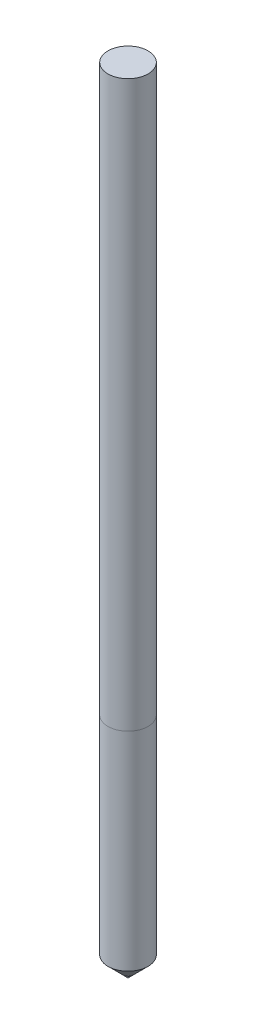
ISO-10303-21;
HEADER;
FILE_DESCRIPTION(('STEP AP214'),'2;1');
FILE_NAME('part.step','',(''),(''),'','','');
FILE_SCHEMA(('AUTOMOTIVE_DESIGN { 1 0 10303 214 1 1 1 1 }'));
ENDSEC;
DATA;
#1=APPLICATION_CONTEXT('core data for automotive mechanical design processes');
#2=APPLICATION_PROTOCOL_DEFINITION('international standard','automotive_design',2000,#1);
#3=PRODUCT_CONTEXT('',#1,'mechanical');
#4=PRODUCT('Part','Part','',(#3));
#5=PRODUCT_RELATED_PRODUCT_CATEGORY('part','',(#4));
#6=PRODUCT_DEFINITION_FORMATION('','',#4);
#7=PRODUCT_DEFINITION_CONTEXT('part definition',#1,'design');
#8=PRODUCT_DEFINITION('design','',#6,#7);
#9=PRODUCT_DEFINITION_SHAPE('','',#8);
#10=(LENGTH_UNIT() NAMED_UNIT(*) SI_UNIT(.MILLI.,.METRE.));
#11=(NAMED_UNIT(*) PLANE_ANGLE_UNIT() SI_UNIT($,.RADIAN.));
#12=(NAMED_UNIT(*) SI_UNIT($,.STERADIAN.) SOLID_ANGLE_UNIT());
#13=UNCERTAINTY_MEASURE_WITH_UNIT(LENGTH_MEASURE(1.E-05),#10,'distance_accuracy_value','');
#14=(GEOMETRIC_REPRESENTATION_CONTEXT(3) GLOBAL_UNCERTAINTY_ASSIGNED_CONTEXT((#13)) GLOBAL_UNIT_ASSIGNED_CONTEXT((#10,
#11,#12)) REPRESENTATION_CONTEXT('',''));
#15=CARTESIAN_POINT('',(0.,0.,0.));
#16=DIRECTION('',(0.,0.,1.));
#17=DIRECTION('',(1.,0.,0.));
#18=AXIS2_PLACEMENT_3D('',#15,#16,#17);
#19=CARTESIAN_POINT('',(1.41692612942607,-73.413671521868,0.));
#20=DIRECTION('',(0.,-1.,0.));
#21=DIRECTION('',(1.,0.,0.));
#22=AXIS2_PLACEMENT_3D('',#19,#20,#21);
#23=CYLINDRICAL_SURFACE('',#22,3.49999999999999);
#24=CARTESIAN_POINT('',(1.41692612942607,-69.9090042150935,0.));
#25=DIRECTION('',(0.,-1.,0.));
#26=DIRECTION('',(1.,0.,0.));
#27=AXIS2_PLACEMENT_3D('',#24,#25,#26);
#28=CIRCLE('',#27,3.5);
#29=CARTESIAN_POINT('',(4.91692612942607,-69.9090042150935,0.));
#30=VERTEX_POINT('',#29);
#31=EDGE_CURVE('E55',#30,#30,#28,.T.);
#32=ORIENTED_EDGE('',*,*,#31,.F.);
#33=EDGE_LOOP('',(#32));
#34=FACE_BOUND('',#33,.T.);
#35=CARTESIAN_POINT('',(1.41692612942607,-33.613671521868,0.));
#36=DIRECTION('',(0.,1.,0.));
#37=DIRECTION('',(-1.,0.,0.));
#38=AXIS2_PLACEMENT_3D('',#35,#36,#37);
#39=CIRCLE('',#38,3.49999999999999);
#40=CARTESIAN_POINT('',(-2.08307387057393,-33.613671521868,0.));
#41=VERTEX_POINT('',#40);
#42=EDGE_CURVE('E11',#41,#41,#39,.F.);
#43=ORIENTED_EDGE('',*,*,#42,.T.);
#44=EDGE_LOOP('',(#43));
#45=FACE_BOUND('',#44,.T.);
#46=ADVANCED_FACE('F47',(#34,#45),#23,.T.);
#47=ORIENTED_EDGE('',*,*,#42,.F.);
#48=EDGE_LOOP('',(#47));
#49=FACE_BOUND('',#48,.T.);
#50=CARTESIAN_POINT('',(1.41692612942606,65.0909957849065,0.));
#51=DIRECTION('',(0.,-1.,0.));
#52=DIRECTION('',(1.,0.,0.));
#53=AXIS2_PLACEMENT_3D('',#50,#51,#52);
#54=CIRCLE('',#53,3.49999999999999);
#55=CARTESIAN_POINT('',(4.91692612942604,65.0909957849065,0.));
#56=VERTEX_POINT('',#55);
#57=EDGE_CURVE('E80',#56,#56,#54,.T.);
#58=ORIENTED_EDGE('',*,*,#57,.T.);
#59=EDGE_LOOP('',(#58));
#60=FACE_BOUND('',#59,.T.);
#61=ADVANCED_FACE('F49',(#49,#60),#23,.T.);
#62=CARTESIAN_POINT('',(1.41692612942607,-73.413671521868,0.));
#63=DIRECTION('',(0.,1.,0.));
#64=DIRECTION('',(-1.,0.,0.));
#65=AXIS2_PLACEMENT_3D('',#62,#63,#64);
#66=CONICAL_SURFACE('',#65,0.,0.784731849655577);
#67=ORIENTED_EDGE('',*,*,#31,.T.);
#68=EDGE_LOOP('',(#67));
#69=FACE_BOUND('',#68,.T.);
#70=CARTESIAN_POINT('',(1.41692612942607,-73.413671521868,0.));
#71=VERTEX_POINT('',#70);
#72=VERTEX_LOOP('',#71);
#73=FACE_BOUND('',#72,.T.);
#74=ADVANCED_FACE('F58',(#69,#73),#66,.T.);
#75=CARTESIAN_POINT('',(0.,65.0909957849065,0.));
#76=DIRECTION('',(0.,-1.,0.));
#77=DIRECTION('',(1.,0.,0.));
#78=AXIS2_PLACEMENT_3D('',#75,#76,#77);
#79=PLANE('',#78);
#80=ORIENTED_EDGE('',*,*,#57,.F.);
#81=EDGE_LOOP('',(#80));
#82=FACE_BOUND('',#81,.T.);
#83=ADVANCED_FACE('F60',(#82),#79,.F.);
#84=CLOSED_SHELL('',(#46,#61,#74,#83));
#85=MANIFOLD_SOLID_BREP('B2',#84);
#86=ADVANCED_BREP_SHAPE_REPRESENTATION('',(#18,#85),#14);
#87=SHAPE_DEFINITION_REPRESENTATION(#9,#86);
ENDSEC;
END-ISO-10303-21;
